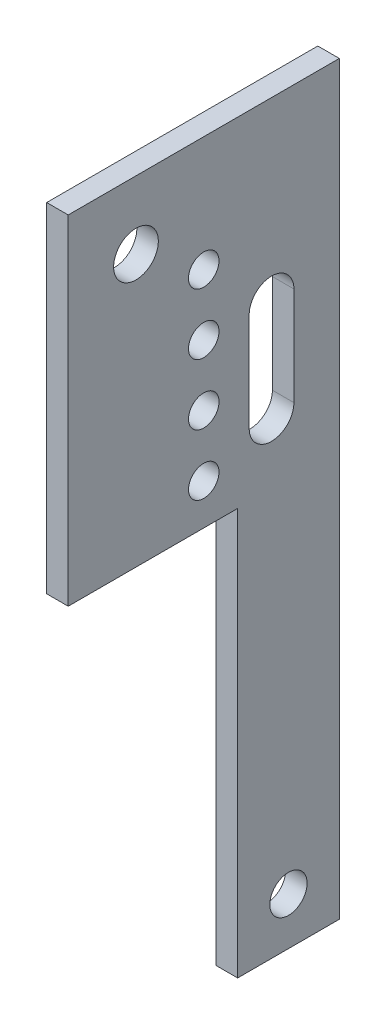
ISO-10303-21;
HEADER;
FILE_DESCRIPTION(('STEP AP214'),'2;1');
FILE_NAME('part.step','',(''),(''),'','','');
FILE_SCHEMA(('AUTOMOTIVE_DESIGN { 1 0 10303 214 1 1 1 1 }'));
ENDSEC;
DATA;
#1=APPLICATION_CONTEXT('core data for automotive mechanical design processes');
#2=APPLICATION_PROTOCOL_DEFINITION('international standard','automotive_design',2000,#1);
#3=PRODUCT_CONTEXT('',#1,'mechanical');
#4=PRODUCT('Part','Part','',(#3));
#5=PRODUCT_RELATED_PRODUCT_CATEGORY('part','',(#4));
#6=PRODUCT_DEFINITION_FORMATION('','',#4);
#7=PRODUCT_DEFINITION_CONTEXT('part definition',#1,'design');
#8=PRODUCT_DEFINITION('design','',#6,#7);
#9=PRODUCT_DEFINITION_SHAPE('','',#8);
#10=(LENGTH_UNIT() NAMED_UNIT(*) SI_UNIT(.MILLI.,.METRE.));
#11=(NAMED_UNIT(*) PLANE_ANGLE_UNIT() SI_UNIT($,.RADIAN.));
#12=(NAMED_UNIT(*) SI_UNIT($,.STERADIAN.) SOLID_ANGLE_UNIT());
#13=UNCERTAINTY_MEASURE_WITH_UNIT(LENGTH_MEASURE(1.E-05),#10,'distance_accuracy_value','');
#14=(GEOMETRIC_REPRESENTATION_CONTEXT(3) GLOBAL_UNCERTAINTY_ASSIGNED_CONTEXT((#13)) GLOBAL_UNIT_ASSIGNED_CONTEXT((#10,
#11,#12)) REPRESENTATION_CONTEXT('',''));
#15=CARTESIAN_POINT('',(0.,0.,0.));
#16=DIRECTION('',(0.,0.,1.));
#17=DIRECTION('',(1.,0.,0.));
#18=AXIS2_PLACEMENT_3D('',#15,#16,#17);
#19=CARTESIAN_POINT('',(3.175,0.,0.));
#20=DIRECTION('',(-1.,0.,0.));
#21=DIRECTION('',(0.,0.,1.));
#22=AXIS2_PLACEMENT_3D('',#19,#20,#21);
#23=PLANE('',#22);
#24=CARTESIAN_POINT('',(3.175,-43.9748496284693,-20.));
#25=DIRECTION('',(1.,0.,0.));
#26=DIRECTION('',(0.,0.,-1.));
#27=AXIS2_PLACEMENT_3D('',#24,#25,#26);
#28=CIRCLE('',#27,2.25);
#29=CARTESIAN_POINT('',(3.175,-43.9748496284693,-22.25));
#30=VERTEX_POINT('',#29);
#31=EDGE_CURVE('E172',#30,#30,#28,.T.);
#32=ORIENTED_EDGE('',*,*,#31,.F.);
#33=EDGE_LOOP('',(#32));
#34=FACE_BOUND('',#33,.T.);
#35=CARTESIAN_POINT('',(3.175,-34.9748496284693,-20.));
#36=DIRECTION('',(1.,0.,0.));
#37=DIRECTION('',(0.,0.,-1.));
#38=AXIS2_PLACEMENT_3D('',#35,#36,#37);
#39=CIRCLE('',#38,2.25);
#40=CARTESIAN_POINT('',(3.175,-34.9748496284693,-22.25));
#41=VERTEX_POINT('',#40);
#42=EDGE_CURVE('E182',#41,#41,#39,.T.);
#43=ORIENTED_EDGE('',*,*,#42,.F.);
#44=EDGE_LOOP('',(#43));
#45=FACE_BOUND('',#44,.T.);
#46=CARTESIAN_POINT('',(3.175,-16.9748496284693,-20.));
#47=DIRECTION('',(1.,0.,0.));
#48=DIRECTION('',(0.,0.,-1.));
#49=AXIS2_PLACEMENT_3D('',#46,#47,#48);
#50=CIRCLE('',#49,2.25);
#51=CARTESIAN_POINT('',(3.175,-16.9748496284693,-22.25));
#52=VERTEX_POINT('',#51);
#53=EDGE_CURVE('E190',#52,#52,#50,.T.);
#54=ORIENTED_EDGE('',*,*,#53,.F.);
#55=EDGE_LOOP('',(#54));
#56=FACE_BOUND('',#55,.T.);
#57=CARTESIAN_POINT('',(3.175,-25.9748496284693,-20.));
#58=DIRECTION('',(1.,0.,0.));
#59=DIRECTION('',(0.,0.,-1.));
#60=AXIS2_PLACEMENT_3D('',#57,#58,#59);
#61=CIRCLE('',#60,2.25);
#62=CARTESIAN_POINT('',(3.175,-25.9748496284693,-22.25));
#63=VERTEX_POINT('',#62);
#64=EDGE_CURVE('E197',#63,#63,#61,.T.);
#65=ORIENTED_EDGE('',*,*,#64,.F.);
#66=EDGE_LOOP('',(#65));
#67=FACE_BOUND('',#66,.T.);
#68=CARTESIAN_POINT('',(3.175,-10.,-10.));
#69=DIRECTION('',(1.,0.,0.));
#70=DIRECTION('',(0.,0.,-1.));
#71=AXIS2_PLACEMENT_3D('',#68,#69,#70);
#72=CIRCLE('',#71,3.3);
#73=CARTESIAN_POINT('',(3.175,-10.,-13.3));
#74=VERTEX_POINT('',#73);
#75=EDGE_CURVE('E202',#74,#74,#72,.T.);
#76=ORIENTED_EDGE('',*,*,#75,.F.);
#77=EDGE_LOOP('',(#76));
#78=FACE_BOUND('',#77,.T.);
#79=DIRECTION('',(0.,-1.,0.));
#80=VECTOR('',#79,1.);
#81=CARTESIAN_POINT('',(3.175,0.,0.));
#82=LINE('',#81,#80);
#83=CARTESIAN_POINT('',(3.175,0.,0.));
#84=VERTEX_POINT('',#83);
#85=CARTESIAN_POINT('',(3.175,-50.,0.));
#86=VERTEX_POINT('',#85);
#87=EDGE_CURVE('E213',#84,#86,#82,.T.);
#88=ORIENTED_EDGE('',*,*,#87,.T.);
#89=DIRECTION('',(0.,0.,-1.));
#90=VECTOR('',#89,1.);
#91=CARTESIAN_POINT('',(3.175,-50.,-25.));
#92=LINE('',#91,#90);
#93=CARTESIAN_POINT('',(3.175,-50.,-25.));
#94=VERTEX_POINT('',#93);
#95=EDGE_CURVE('E220',#86,#94,#92,.T.);
#96=ORIENTED_EDGE('',*,*,#95,.T.);
#97=DIRECTION('',(0.,-1.,0.));
#98=VECTOR('',#97,1.);
#99=CARTESIAN_POINT('',(3.175,-110.,-25.));
#100=LINE('',#99,#98);
#101=CARTESIAN_POINT('',(3.175,-110.,-25.));
#102=VERTEX_POINT('',#101);
#103=EDGE_CURVE('E222',#94,#102,#100,.T.);
#104=ORIENTED_EDGE('',*,*,#103,.T.);
#105=DIRECTION('',(0.,0.,-1.));
#106=VECTOR('',#105,1.);
#107=CARTESIAN_POINT('',(3.175,-110.,-40.));
#108=LINE('',#107,#106);
#109=CARTESIAN_POINT('',(3.175,-110.,-40.));
#110=VERTEX_POINT('',#109);
#111=EDGE_CURVE('E221',#102,#110,#108,.T.);
#112=ORIENTED_EDGE('',*,*,#111,.T.);
#113=DIRECTION('',(0.,1.,0.));
#114=VECTOR('',#113,1.);
#115=CARTESIAN_POINT('',(3.175,-50.,-40.));
#116=LINE('',#115,#114);
#117=CARTESIAN_POINT('',(3.175,0.,-40.));
#118=VERTEX_POINT('',#117);
#119=EDGE_CURVE('E229',#110,#118,#116,.T.);
#120=ORIENTED_EDGE('',*,*,#119,.T.);
#121=DIRECTION('',(0.,0.,1.));
#122=VECTOR('',#121,1.);
#123=CARTESIAN_POINT('',(3.175,0.,-40.));
#124=LINE('',#123,#122);
#125=EDGE_CURVE('E226',#118,#84,#124,.T.);
#126=ORIENTED_EDGE('',*,*,#125,.T.);
#127=EDGE_LOOP('',(#88,#96,#104,#112,#120,#126));
#128=FACE_BOUND('',#127,.T.);
#129=CARTESIAN_POINT('',(3.175,-26.1084336883801,-30.));
#130=DIRECTION('',(1.,0.,0.));
#131=DIRECTION('',(0.,0.,-1.));
#132=AXIS2_PLACEMENT_3D('',#129,#130,#131);
#133=CIRCLE('',#132,3.3);
#134=CARTESIAN_POINT('',(3.175,-26.1084336883801,-33.3));
#135=VERTEX_POINT('',#134);
#136=CARTESIAN_POINT('',(3.175,-26.1084336883801,-26.7));
#137=VERTEX_POINT('',#136);
#138=EDGE_CURVE('E122',#135,#137,#133,.T.);
#139=ORIENTED_EDGE('',*,*,#138,.F.);
#140=DIRECTION('',(0.,1.,0.));
#141=VECTOR('',#140,1.);
#142=CARTESIAN_POINT('',(3.175,-26.1084336883801,-33.3));
#143=LINE('',#142,#141);
#144=CARTESIAN_POINT('',(3.175,-40.6292085470998,-33.3));
#145=VERTEX_POINT('',#144);
#146=EDGE_CURVE('E149',#145,#135,#143,.T.);
#147=ORIENTED_EDGE('',*,*,#146,.F.);
#148=CARTESIAN_POINT('',(3.175,-40.6292085470998,-30.));
#149=DIRECTION('',(1.,0.,0.));
#150=DIRECTION('',(0.,0.,-1.));
#151=AXIS2_PLACEMENT_3D('',#148,#149,#150);
#152=CIRCLE('',#151,3.3);
#153=CARTESIAN_POINT('',(3.175,-40.6292085470998,-26.7));
#154=VERTEX_POINT('',#153);
#155=EDGE_CURVE('E144',#154,#145,#152,.T.);
#156=ORIENTED_EDGE('',*,*,#155,.F.);
#157=DIRECTION('',(0.,-1.,0.));
#158=VECTOR('',#157,1.);
#159=CARTESIAN_POINT('',(3.175,-26.1084336883801,-26.7));
#160=LINE('',#159,#158);
#161=EDGE_CURVE('E133',#137,#154,#160,.T.);
#162=ORIENTED_EDGE('',*,*,#161,.F.);
#163=EDGE_LOOP('',(#139,#147,#156,#162));
#164=FACE_BOUND('',#163,.T.);
#165=CARTESIAN_POINT('',(3.175,-103.,-32.5));
#166=DIRECTION('',(1.,0.,0.));
#167=DIRECTION('',(0.,0.,-1.));
#168=AXIS2_PLACEMENT_3D('',#165,#166,#167);
#169=CIRCLE('',#168,2.75);
#170=CARTESIAN_POINT('',(3.175,-103.,-35.25));
#171=VERTEX_POINT('',#170);
#172=EDGE_CURVE('E160',#171,#171,#169,.T.);
#173=ORIENTED_EDGE('',*,*,#172,.F.);
#174=EDGE_LOOP('',(#173));
#175=FACE_BOUND('',#174,.T.);
#176=ADVANCED_FACE('F42',(#34,#45,#56,#67,#78,#128,#164,#175),#23,.F.);
#177=CARTESIAN_POINT('',(0.,0.,0.));
#178=DIRECTION('',(-1.,0.,0.));
#179=DIRECTION('',(0.,0.,1.));
#180=AXIS2_PLACEMENT_3D('',#177,#178,#179);
#181=PLANE('',#180);
#182=DIRECTION('',(0.,1.,0.));
#183=VECTOR('',#182,1.);
#184=CARTESIAN_POINT('',(0.,-26.1084336883801,-33.3));
#185=LINE('',#184,#183);
#186=CARTESIAN_POINT('',(0.,-40.6292085470998,-33.3));
#187=VERTEX_POINT('',#186);
#188=CARTESIAN_POINT('',(0.,-26.1084336883801,-33.3));
#189=VERTEX_POINT('',#188);
#190=EDGE_CURVE('E134',#187,#189,#185,.T.);
#191=ORIENTED_EDGE('',*,*,#190,.T.);
#192=CARTESIAN_POINT('',(0.,-26.1084336883801,-30.));
#193=DIRECTION('',(1.,0.,0.));
#194=DIRECTION('',(0.,0.,-1.));
#195=AXIS2_PLACEMENT_3D('',#192,#193,#194);
#196=CIRCLE('',#195,3.3);
#197=CARTESIAN_POINT('',(0.,-26.1084336883801,-26.7));
#198=VERTEX_POINT('',#197);
#199=EDGE_CURVE('E69',#189,#198,#196,.T.);
#200=ORIENTED_EDGE('',*,*,#199,.T.);
#201=DIRECTION('',(0.,-1.,0.));
#202=VECTOR('',#201,1.);
#203=CARTESIAN_POINT('',(0.,-26.1084336883801,-26.7));
#204=LINE('',#203,#202);
#205=CARTESIAN_POINT('',(0.,-40.6292085470998,-26.7));
#206=VERTEX_POINT('',#205);
#207=EDGE_CURVE('E139',#198,#206,#204,.T.);
#208=ORIENTED_EDGE('',*,*,#207,.T.);
#209=CARTESIAN_POINT('',(0.,-40.6292085470998,-30.));
#210=DIRECTION('',(1.,0.,0.));
#211=DIRECTION('',(0.,0.,-1.));
#212=AXIS2_PLACEMENT_3D('',#209,#210,#211);
#213=CIRCLE('',#212,3.3);
#214=EDGE_CURVE('E159',#206,#187,#213,.T.);
#215=ORIENTED_EDGE('',*,*,#214,.T.);
#216=EDGE_LOOP('',(#191,#200,#208,#215));
#217=FACE_BOUND('',#216,.T.);
#218=CARTESIAN_POINT('',(0.,-43.9748496284693,-20.));
#219=DIRECTION('',(1.,0.,0.));
#220=DIRECTION('',(0.,0.,-1.));
#221=AXIS2_PLACEMENT_3D('',#218,#219,#220);
#222=CIRCLE('',#221,2.25);
#223=CARTESIAN_POINT('',(0.,-43.9748496284693,-22.25));
#224=VERTEX_POINT('',#223);
#225=EDGE_CURVE('E140',#224,#224,#222,.T.);
#226=ORIENTED_EDGE('',*,*,#225,.T.);
#227=EDGE_LOOP('',(#226));
#228=FACE_BOUND('',#227,.T.);
#229=CARTESIAN_POINT('',(0.,-16.9748496284693,-20.));
#230=DIRECTION('',(1.,0.,0.));
#231=DIRECTION('',(0.,0.,-1.));
#232=AXIS2_PLACEMENT_3D('',#229,#230,#231);
#233=CIRCLE('',#232,2.25);
#234=CARTESIAN_POINT('',(0.,-16.9748496284693,-22.25));
#235=VERTEX_POINT('',#234);
#236=EDGE_CURVE('E183',#235,#235,#233,.T.);
#237=ORIENTED_EDGE('',*,*,#236,.T.);
#238=EDGE_LOOP('',(#237));
#239=FACE_BOUND('',#238,.T.);
#240=CARTESIAN_POINT('',(0.,-10.,-10.));
#241=DIRECTION('',(1.,0.,0.));
#242=DIRECTION('',(0.,0.,-1.));
#243=AXIS2_PLACEMENT_3D('',#240,#241,#242);
#244=CIRCLE('',#243,3.3);
#245=CARTESIAN_POINT('',(0.,-10.,-13.3));
#246=VERTEX_POINT('',#245);
#247=EDGE_CURVE('E203',#246,#246,#244,.T.);
#248=ORIENTED_EDGE('',*,*,#247,.T.);
#249=EDGE_LOOP('',(#248));
#250=FACE_BOUND('',#249,.T.);
#251=DIRECTION('',(0.,-1.,0.));
#252=VECTOR('',#251,1.);
#253=CARTESIAN_POINT('',(0.,0.,0.));
#254=LINE('',#253,#252);
#255=CARTESIAN_POINT('',(0.,0.,0.));
#256=VERTEX_POINT('',#255);
#257=CARTESIAN_POINT('',(0.,-50.,0.));
#258=VERTEX_POINT('',#257);
#259=EDGE_CURVE('E207',#256,#258,#254,.T.);
#260=ORIENTED_EDGE('',*,*,#259,.F.);
#261=DIRECTION('',(0.,0.,1.));
#262=VECTOR('',#261,1.);
#263=CARTESIAN_POINT('',(0.,0.,-40.));
#264=LINE('',#263,#262);
#265=CARTESIAN_POINT('',(0.,0.,-40.));
#266=VERTEX_POINT('',#265);
#267=EDGE_CURVE('E217',#266,#256,#264,.T.);
#268=ORIENTED_EDGE('',*,*,#267,.F.);
#269=DIRECTION('',(0.,1.,0.));
#270=VECTOR('',#269,1.);
#271=CARTESIAN_POINT('',(0.,0.,-40.));
#272=LINE('',#271,#270);
#273=CARTESIAN_POINT('',(0.,-110.,-40.));
#274=VERTEX_POINT('',#273);
#275=EDGE_CURVE('E247',#274,#266,#272,.T.);
#276=ORIENTED_EDGE('',*,*,#275,.F.);
#277=DIRECTION('',(0.,0.,-1.));
#278=VECTOR('',#277,1.);
#279=CARTESIAN_POINT('',(0.,-110.,-40.));
#280=LINE('',#279,#278);
#281=CARTESIAN_POINT('',(0.,-110.,-25.));
#282=VERTEX_POINT('',#281);
#283=EDGE_CURVE('E242',#282,#274,#280,.T.);
#284=ORIENTED_EDGE('',*,*,#283,.F.);
#285=DIRECTION('',(0.,-1.,0.));
#286=VECTOR('',#285,1.);
#287=CARTESIAN_POINT('',(0.,-110.,-25.));
#288=LINE('',#287,#286);
#289=CARTESIAN_POINT('',(0.,-50.,-25.));
#290=VERTEX_POINT('',#289);
#291=EDGE_CURVE('E238',#290,#282,#288,.T.);
#292=ORIENTED_EDGE('',*,*,#291,.F.);
#293=DIRECTION('',(0.,0.,-1.));
#294=VECTOR('',#293,1.);
#295=CARTESIAN_POINT('',(0.,-50.,-25.));
#296=LINE('',#295,#294);
#297=EDGE_CURVE('E240',#258,#290,#296,.T.);
#298=ORIENTED_EDGE('',*,*,#297,.F.);
#299=EDGE_LOOP('',(#260,#268,#276,#284,#292,#298));
#300=FACE_BOUND('',#299,.T.);
#301=CARTESIAN_POINT('',(0.,-25.9748496284693,-20.));
#302=DIRECTION('',(1.,0.,0.));
#303=DIRECTION('',(0.,0.,-1.));
#304=AXIS2_PLACEMENT_3D('',#301,#302,#303);
#305=CIRCLE('',#304,2.25);
#306=CARTESIAN_POINT('',(0.,-25.9748496284693,-22.25));
#307=VERTEX_POINT('',#306);
#308=EDGE_CURVE('E194',#307,#307,#305,.T.);
#309=ORIENTED_EDGE('',*,*,#308,.T.);
#310=EDGE_LOOP('',(#309));
#311=FACE_BOUND('',#310,.T.);
#312=CARTESIAN_POINT('',(0.,-34.9748496284693,-20.));
#313=DIRECTION('',(1.,0.,0.));
#314=DIRECTION('',(0.,0.,-1.));
#315=AXIS2_PLACEMENT_3D('',#312,#313,#314);
#316=CIRCLE('',#315,2.25);
#317=CARTESIAN_POINT('',(0.,-34.9748496284693,-22.25));
#318=VERTEX_POINT('',#317);
#319=EDGE_CURVE('E177',#318,#318,#316,.T.);
#320=ORIENTED_EDGE('',*,*,#319,.T.);
#321=EDGE_LOOP('',(#320));
#322=FACE_BOUND('',#321,.T.);
#323=CARTESIAN_POINT('',(0.,-103.,-32.5));
#324=DIRECTION('',(1.,0.,0.));
#325=DIRECTION('',(0.,0.,-1.));
#326=AXIS2_PLACEMENT_3D('',#323,#324,#325);
#327=CIRCLE('',#326,2.75);
#328=CARTESIAN_POINT('',(0.,-103.,-35.25));
#329=VERTEX_POINT('',#328);
#330=EDGE_CURVE('E356',#329,#329,#327,.T.);
#331=ORIENTED_EDGE('',*,*,#330,.T.);
#332=EDGE_LOOP('',(#331));
#333=FACE_BOUND('',#332,.T.);
#334=ADVANCED_FACE('F279',(#217,#228,#239,#250,#300,#311,#322,#333),#181,.T.);
#335=CARTESIAN_POINT('',(3.175,0.,0.));
#336=DIRECTION('',(0.,0.,-1.));
#337=DIRECTION('',(0.,1.,0.));
#338=AXIS2_PLACEMENT_3D('',#335,#336,#337);
#339=PLANE('',#338);
#340=ORIENTED_EDGE('',*,*,#259,.T.);
#341=DIRECTION('',(-1.,0.,0.));
#342=VECTOR('',#341,1.);
#343=CARTESIAN_POINT('',(3.175,-50.,0.));
#344=LINE('',#343,#342);
#345=EDGE_CURVE('E11',#86,#258,#344,.T.);
#346=ORIENTED_EDGE('',*,*,#345,.F.);
#347=ORIENTED_EDGE('',*,*,#87,.F.);
#348=DIRECTION('',(-1.,0.,0.));
#349=VECTOR('',#348,1.);
#350=CARTESIAN_POINT('',(3.175,0.,0.));
#351=LINE('',#350,#349);
#352=EDGE_CURVE('E234',#84,#256,#351,.T.);
#353=ORIENTED_EDGE('',*,*,#352,.T.);
#354=EDGE_LOOP('',(#340,#346,#347,#353));
#355=FACE_BOUND('',#354,.T.);
#356=ADVANCED_FACE('F46',(#355),#339,.F.);
#357=CARTESIAN_POINT('',(3.175,-50.,-25.));
#358=DIRECTION('',(0.,1.,0.));
#359=DIRECTION('',(0.,0.,1.));
#360=AXIS2_PLACEMENT_3D('',#357,#358,#359);
#361=PLANE('',#360);
#362=ORIENTED_EDGE('',*,*,#297,.T.);
#363=DIRECTION('',(-1.,0.,0.));
#364=VECTOR('',#363,1.);
#365=CARTESIAN_POINT('',(3.175,-50.,-25.));
#366=LINE('',#365,#364);
#367=EDGE_CURVE('E52',#94,#290,#366,.T.);
#368=ORIENTED_EDGE('',*,*,#367,.F.);
#369=ORIENTED_EDGE('',*,*,#95,.F.);
#370=ORIENTED_EDGE('',*,*,#345,.T.);
#371=EDGE_LOOP('',(#362,#368,#369,#370));
#372=FACE_BOUND('',#371,.T.);
#373=ADVANCED_FACE('F294',(#372),#361,.F.);
#374=CARTESIAN_POINT('',(3.175,-110.,-25.));
#375=DIRECTION('',(0.,0.,-1.));
#376=DIRECTION('',(0.,1.,0.));
#377=AXIS2_PLACEMENT_3D('',#374,#375,#376);
#378=PLANE('',#377);
#379=ORIENTED_EDGE('',*,*,#291,.T.);
#380=DIRECTION('',(-1.,0.,0.));
#381=VECTOR('',#380,1.);
#382=CARTESIAN_POINT('',(3.175,-110.,-25.));
#383=LINE('',#382,#381);
#384=EDGE_CURVE('E263',#102,#282,#383,.T.);
#385=ORIENTED_EDGE('',*,*,#384,.F.);
#386=ORIENTED_EDGE('',*,*,#103,.F.);
#387=ORIENTED_EDGE('',*,*,#367,.T.);
#388=EDGE_LOOP('',(#379,#385,#386,#387));
#389=FACE_BOUND('',#388,.T.);
#390=ADVANCED_FACE('F275',(#389),#378,.F.);
#391=CARTESIAN_POINT('',(3.175,-110.,-40.));
#392=DIRECTION('',(0.,1.,0.));
#393=DIRECTION('',(0.,0.,1.));
#394=AXIS2_PLACEMENT_3D('',#391,#392,#393);
#395=PLANE('',#394);
#396=ORIENTED_EDGE('',*,*,#283,.T.);
#397=DIRECTION('',(-1.,0.,0.));
#398=VECTOR('',#397,1.);
#399=CARTESIAN_POINT('',(3.175,-110.,-40.));
#400=LINE('',#399,#398);
#401=EDGE_CURVE('E259',#110,#274,#400,.T.);
#402=ORIENTED_EDGE('',*,*,#401,.F.);
#403=ORIENTED_EDGE('',*,*,#111,.F.);
#404=ORIENTED_EDGE('',*,*,#384,.T.);
#405=EDGE_LOOP('',(#396,#402,#403,#404));
#406=FACE_BOUND('',#405,.T.);
#407=ADVANCED_FACE('F282',(#406),#395,.F.);
#408=CARTESIAN_POINT('',(3.175,0.,-40.));
#409=DIRECTION('',(0.,0.,1.));
#410=DIRECTION('',(0.,-1.,0.));
#411=AXIS2_PLACEMENT_3D('',#408,#409,#410);
#412=PLANE('',#411);
#413=ORIENTED_EDGE('',*,*,#275,.T.);
#414=DIRECTION('',(-1.,0.,0.));
#415=VECTOR('',#414,1.);
#416=CARTESIAN_POINT('',(3.175,0.,-40.));
#417=LINE('',#416,#415);
#418=EDGE_CURVE('E254',#118,#266,#417,.T.);
#419=ORIENTED_EDGE('',*,*,#418,.F.);
#420=ORIENTED_EDGE('',*,*,#119,.F.);
#421=ORIENTED_EDGE('',*,*,#401,.T.);
#422=EDGE_LOOP('',(#413,#419,#420,#421));
#423=FACE_BOUND('',#422,.T.);
#424=ADVANCED_FACE('F287',(#423),#412,.F.);
#425=CARTESIAN_POINT('',(3.175,0.,-40.));
#426=DIRECTION('',(0.,-1.,0.));
#427=DIRECTION('',(0.,0.,-1.));
#428=AXIS2_PLACEMENT_3D('',#425,#426,#427);
#429=PLANE('',#428);
#430=ORIENTED_EDGE('',*,*,#267,.T.);
#431=ORIENTED_EDGE('',*,*,#352,.F.);
#432=ORIENTED_EDGE('',*,*,#125,.F.);
#433=ORIENTED_EDGE('',*,*,#418,.T.);
#434=EDGE_LOOP('',(#430,#431,#432,#433));
#435=FACE_BOUND('',#434,.T.);
#436=ADVANCED_FACE('F299',(#435),#429,.F.);
#437=CARTESIAN_POINT('',(3.175,-10.,-10.));
#438=DIRECTION('',(-1.,0.,0.));
#439=DIRECTION('',(0.,0.,1.));
#440=AXIS2_PLACEMENT_3D('',#437,#438,#439);
#441=CYLINDRICAL_SURFACE('',#440,3.3);
#442=ORIENTED_EDGE('',*,*,#75,.T.);
#443=EDGE_LOOP('',(#442));
#444=FACE_BOUND('',#443,.T.);
#445=ORIENTED_EDGE('',*,*,#247,.F.);
#446=EDGE_LOOP('',(#445));
#447=FACE_BOUND('',#446,.T.);
#448=ADVANCED_FACE('F300',(#444,#447),#441,.F.);
#449=CARTESIAN_POINT('',(3.175,-25.9748496284693,-20.));
#450=DIRECTION('',(-1.,0.,0.));
#451=DIRECTION('',(0.,0.,1.));
#452=AXIS2_PLACEMENT_3D('',#449,#450,#451);
#453=CYLINDRICAL_SURFACE('',#452,2.25);
#454=ORIENTED_EDGE('',*,*,#64,.T.);
#455=EDGE_LOOP('',(#454));
#456=FACE_BOUND('',#455,.T.);
#457=ORIENTED_EDGE('',*,*,#308,.F.);
#458=EDGE_LOOP('',(#457));
#459=FACE_BOUND('',#458,.T.);
#460=ADVANCED_FACE('F305',(#456,#459),#453,.F.);
#461=CARTESIAN_POINT('',(3.175,-16.9748496284693,-20.));
#462=DIRECTION('',(-1.,0.,0.));
#463=DIRECTION('',(0.,0.,1.));
#464=AXIS2_PLACEMENT_3D('',#461,#462,#463);
#465=CYLINDRICAL_SURFACE('',#464,2.25);
#466=ORIENTED_EDGE('',*,*,#53,.T.);
#467=EDGE_LOOP('',(#466));
#468=FACE_BOUND('',#467,.T.);
#469=ORIENTED_EDGE('',*,*,#236,.F.);
#470=EDGE_LOOP('',(#469));
#471=FACE_BOUND('',#470,.T.);
#472=ADVANCED_FACE('F325',(#468,#471),#465,.F.);
#473=CARTESIAN_POINT('',(3.175,-34.9748496284693,-20.));
#474=DIRECTION('',(-1.,0.,0.));
#475=DIRECTION('',(0.,0.,1.));
#476=AXIS2_PLACEMENT_3D('',#473,#474,#475);
#477=CYLINDRICAL_SURFACE('',#476,2.25);
#478=ORIENTED_EDGE('',*,*,#42,.T.);
#479=EDGE_LOOP('',(#478));
#480=FACE_BOUND('',#479,.T.);
#481=ORIENTED_EDGE('',*,*,#319,.F.);
#482=EDGE_LOOP('',(#481));
#483=FACE_BOUND('',#482,.T.);
#484=ADVANCED_FACE('F326',(#480,#483),#477,.F.);
#485=CARTESIAN_POINT('',(3.175,-43.9748496284693,-20.));
#486=DIRECTION('',(-1.,0.,0.));
#487=DIRECTION('',(0.,0.,1.));
#488=AXIS2_PLACEMENT_3D('',#485,#486,#487);
#489=CYLINDRICAL_SURFACE('',#488,2.25);
#490=ORIENTED_EDGE('',*,*,#31,.T.);
#491=EDGE_LOOP('',(#490));
#492=FACE_BOUND('',#491,.T.);
#493=ORIENTED_EDGE('',*,*,#225,.F.);
#494=EDGE_LOOP('',(#493));
#495=FACE_BOUND('',#494,.T.);
#496=ADVANCED_FACE('F329',(#492,#495),#489,.F.);
#497=CARTESIAN_POINT('',(3.175,-26.1084336883801,-30.));
#498=DIRECTION('',(-1.,0.,0.));
#499=DIRECTION('',(0.,0.,1.));
#500=AXIS2_PLACEMENT_3D('',#497,#498,#499);
#501=CYLINDRICAL_SURFACE('',#500,3.3);
#502=ORIENTED_EDGE('',*,*,#199,.F.);
#503=DIRECTION('',(-1.,0.,0.));
#504=VECTOR('',#503,1.);
#505=CARTESIAN_POINT('',(3.175,-26.1084336883801,-33.3));
#506=LINE('',#505,#504);
#507=EDGE_CURVE('E127',#135,#189,#506,.T.);
#508=ORIENTED_EDGE('',*,*,#507,.F.);
#509=ORIENTED_EDGE('',*,*,#138,.T.);
#510=DIRECTION('',(-1.,0.,0.));
#511=VECTOR('',#510,1.);
#512=CARTESIAN_POINT('',(3.175,-26.1084336883801,-26.7));
#513=LINE('',#512,#511);
#514=EDGE_CURVE('E125',#137,#198,#513,.T.);
#515=ORIENTED_EDGE('',*,*,#514,.T.);
#516=EDGE_LOOP('',(#502,#508,#509,#515));
#517=FACE_BOUND('',#516,.T.);
#518=ADVANCED_FACE('F123',(#517),#501,.F.);
#519=CARTESIAN_POINT('',(3.175,-26.1084336883801,-26.7));
#520=DIRECTION('',(0.,0.,-1.));
#521=DIRECTION('',(0.,1.,0.));
#522=AXIS2_PLACEMENT_3D('',#519,#520,#521);
#523=PLANE('',#522);
#524=ORIENTED_EDGE('',*,*,#207,.F.);
#525=ORIENTED_EDGE('',*,*,#514,.F.);
#526=ORIENTED_EDGE('',*,*,#161,.T.);
#527=DIRECTION('',(-1.,0.,0.));
#528=VECTOR('',#527,1.);
#529=CARTESIAN_POINT('',(3.175,-40.6292085470998,-26.7));
#530=LINE('',#529,#528);
#531=EDGE_CURVE('E143',#154,#206,#530,.T.);
#532=ORIENTED_EDGE('',*,*,#531,.T.);
#533=EDGE_LOOP('',(#524,#525,#526,#532));
#534=FACE_BOUND('',#533,.T.);
#535=ADVANCED_FACE('F131',(#534),#523,.T.);
#536=CARTESIAN_POINT('',(3.175,-40.6292085470998,-30.));
#537=DIRECTION('',(-1.,0.,0.));
#538=DIRECTION('',(0.,0.,1.));
#539=AXIS2_PLACEMENT_3D('',#536,#537,#538);
#540=CYLINDRICAL_SURFACE('',#539,3.3);
#541=ORIENTED_EDGE('',*,*,#214,.F.);
#542=ORIENTED_EDGE('',*,*,#531,.F.);
#543=ORIENTED_EDGE('',*,*,#155,.T.);
#544=DIRECTION('',(-1.,0.,0.));
#545=VECTOR('',#544,1.);
#546=CARTESIAN_POINT('',(3.175,-40.6292085470998,-33.3));
#547=LINE('',#546,#545);
#548=EDGE_CURVE('E58',#145,#187,#547,.T.);
#549=ORIENTED_EDGE('',*,*,#548,.T.);
#550=EDGE_LOOP('',(#541,#542,#543,#549));
#551=FACE_BOUND('',#550,.T.);
#552=ADVANCED_FACE('F340',(#551),#540,.F.);
#553=CARTESIAN_POINT('',(3.175,-26.1084336883801,-33.3));
#554=DIRECTION('',(0.,0.,1.));
#555=DIRECTION('',(1.,0.,0.));
#556=AXIS2_PLACEMENT_3D('',#553,#554,#555);
#557=PLANE('',#556);
#558=ORIENTED_EDGE('',*,*,#190,.F.);
#559=ORIENTED_EDGE('',*,*,#548,.F.);
#560=ORIENTED_EDGE('',*,*,#146,.T.);
#561=ORIENTED_EDGE('',*,*,#507,.T.);
#562=EDGE_LOOP('',(#558,#559,#560,#561));
#563=FACE_BOUND('',#562,.T.);
#564=ADVANCED_FACE('F342',(#563),#557,.T.);
#565=CARTESIAN_POINT('',(3.175,-103.,-32.5));
#566=DIRECTION('',(-1.,0.,0.));
#567=DIRECTION('',(0.,0.,1.));
#568=AXIS2_PLACEMENT_3D('',#565,#566,#567);
#569=CYLINDRICAL_SURFACE('',#568,2.75);
#570=ORIENTED_EDGE('',*,*,#172,.T.);
#571=EDGE_LOOP('',(#570));
#572=FACE_BOUND('',#571,.T.);
#573=ORIENTED_EDGE('',*,*,#330,.F.);
#574=EDGE_LOOP('',(#573));
#575=FACE_BOUND('',#574,.T.);
#576=ADVANCED_FACE('F347',(#572,#575),#569,.F.);
#577=CLOSED_SHELL('',(#176,#334,#356,#373,#390,#407,#424,#436,#448,#460,#472,#484,#496,#518,
#535,#552,#564,#576));
#578=MANIFOLD_SOLID_BREP('B2',#577);
#579=ADVANCED_BREP_SHAPE_REPRESENTATION('',(#18,#578),#14);
#580=SHAPE_DEFINITION_REPRESENTATION(#9,#579);
ENDSEC;
END-ISO-10303-21;
